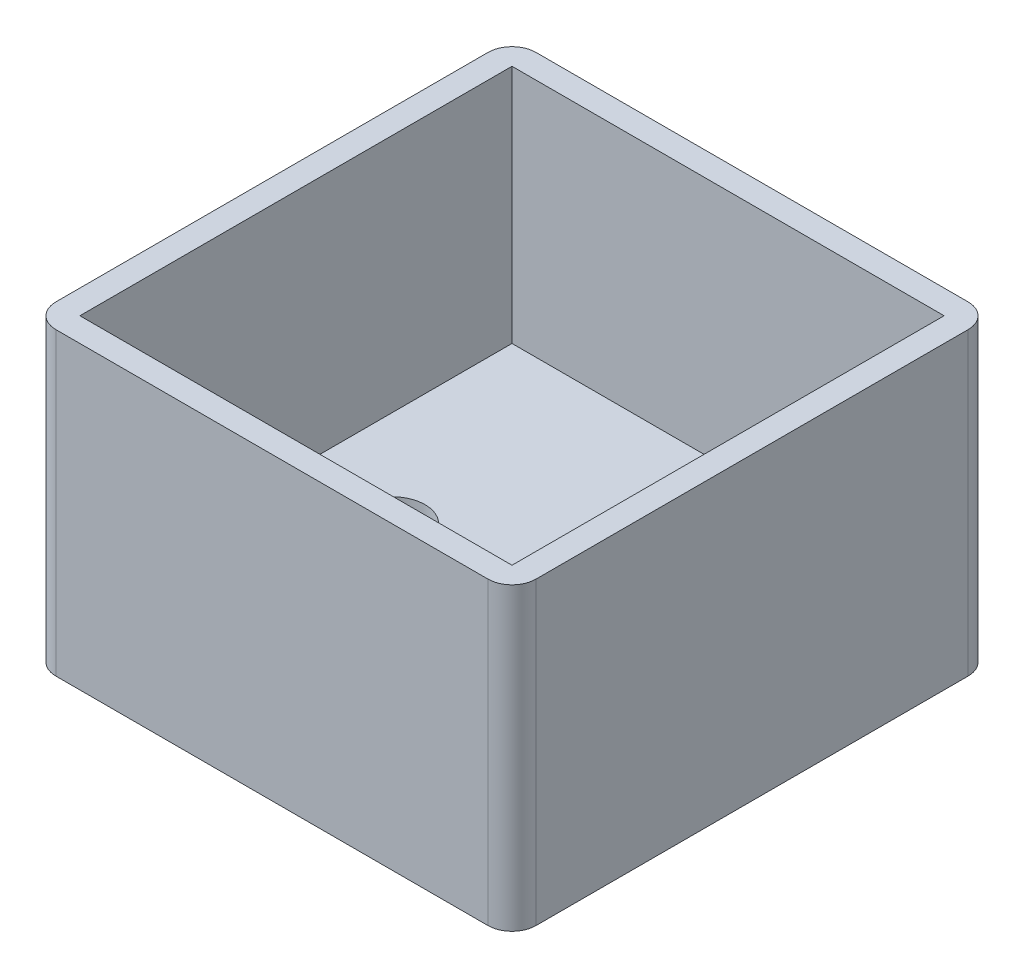
ISO-10303-21;
HEADER;
FILE_DESCRIPTION(('STEP AP214'),'2;1');
FILE_NAME('part.step','',(''),(''),'','','');
FILE_SCHEMA(('AUTOMOTIVE_DESIGN { 1 0 10303 214 1 1 1 1 }'));
ENDSEC;
DATA;
#1=APPLICATION_CONTEXT('core data for automotive mechanical design processes');
#2=APPLICATION_PROTOCOL_DEFINITION('international standard','automotive_design',2000,#1);
#3=PRODUCT_CONTEXT('',#1,'mechanical');
#4=PRODUCT('Part','Part','',(#3));
#5=PRODUCT_RELATED_PRODUCT_CATEGORY('part','',(#4));
#6=PRODUCT_DEFINITION_FORMATION('','',#4);
#7=PRODUCT_DEFINITION_CONTEXT('part definition',#1,'design');
#8=PRODUCT_DEFINITION('design','',#6,#7);
#9=PRODUCT_DEFINITION_SHAPE('','',#8);
#10=(LENGTH_UNIT() NAMED_UNIT(*) SI_UNIT(.MILLI.,.METRE.));
#11=(NAMED_UNIT(*) PLANE_ANGLE_UNIT() SI_UNIT($,.RADIAN.));
#12=(NAMED_UNIT(*) SI_UNIT($,.STERADIAN.) SOLID_ANGLE_UNIT());
#13=UNCERTAINTY_MEASURE_WITH_UNIT(LENGTH_MEASURE(1.E-05),#10,'distance_accuracy_value','');
#14=(GEOMETRIC_REPRESENTATION_CONTEXT(3) GLOBAL_UNCERTAINTY_ASSIGNED_CONTEXT((#13)) GLOBAL_UNIT_ASSIGNED_CONTEXT((#10,
#11,#12)) REPRESENTATION_CONTEXT('',''));
#15=CARTESIAN_POINT('',(0.,0.,0.));
#16=DIRECTION('',(0.,0.,1.));
#17=DIRECTION('',(1.,0.,0.));
#18=AXIS2_PLACEMENT_3D('',#15,#16,#17);
#19=CARTESIAN_POINT('',(2.,5.,-2.));
#20=DIRECTION('',(0.,1.,0.));
#21=DIRECTION('',(0.,0.,1.));
#22=AXIS2_PLACEMENT_3D('',#19,#20,#21);
#23=PLANE('',#22);
#24=DIRECTION('',(-1.,0.,0.));
#25=VECTOR('',#24,1.);
#26=CARTESIAN_POINT('',(38.,5.,-38.));
#27=LINE('',#26,#25);
#28=CARTESIAN_POINT('',(38.,5.,-38.));
#29=VERTEX_POINT('',#28);
#30=CARTESIAN_POINT('',(2.,5.,-38.));
#31=VERTEX_POINT('',#30);
#32=EDGE_CURVE('E54',#29,#31,#27,.T.);
#33=ORIENTED_EDGE('',*,*,#32,.T.);
#34=DIRECTION('',(0.,0.,1.));
#35=VECTOR('',#34,1.);
#36=CARTESIAN_POINT('',(2.,5.,-38.));
#37=LINE('',#36,#35);
#38=CARTESIAN_POINT('',(2.,5.,-2.));
#39=VERTEX_POINT('',#38);
#40=EDGE_CURVE('E58',#31,#39,#37,.T.);
#41=ORIENTED_EDGE('',*,*,#40,.T.);
#42=DIRECTION('',(1.,0.,0.));
#43=VECTOR('',#42,1.);
#44=CARTESIAN_POINT('',(2.,5.,-2.));
#45=LINE('',#44,#43);
#46=CARTESIAN_POINT('',(38.,5.,-2.));
#47=VERTEX_POINT('',#46);
#48=EDGE_CURVE('E156',#39,#47,#45,.T.);
#49=ORIENTED_EDGE('',*,*,#48,.T.);
#50=DIRECTION('',(0.,0.,-1.));
#51=VECTOR('',#50,1.);
#52=CARTESIAN_POINT('',(38.,5.,-2.));
#53=LINE('',#52,#51);
#54=EDGE_CURVE('E137',#47,#29,#53,.T.);
#55=ORIENTED_EDGE('',*,*,#54,.T.);
#56=EDGE_LOOP('',(#33,#41,#49,#55));
#57=FACE_BOUND('',#56,.T.);
#58=CARTESIAN_POINT('',(10.,5.,-20.));
#59=DIRECTION('',(0.,1.,0.));
#60=DIRECTION('',(0.,0.,1.));
#61=AXIS2_PLACEMENT_3D('',#58,#59,#60);
#62=CIRCLE('',#61,2.75);
#63=CARTESIAN_POINT('',(10.,5.,-17.25));
#64=VERTEX_POINT('',#63);
#65=EDGE_CURVE('E194',#64,#64,#62,.T.);
#66=ORIENTED_EDGE('',*,*,#65,.F.);
#67=EDGE_LOOP('',(#66));
#68=FACE_BOUND('',#67,.T.);
#69=CARTESIAN_POINT('',(30.,5.,-20.));
#70=DIRECTION('',(0.,1.,0.));
#71=DIRECTION('',(0.,0.,-1.));
#72=AXIS2_PLACEMENT_3D('',#69,#70,#71);
#73=CIRCLE('',#72,2.75);
#74=CARTESIAN_POINT('',(30.,5.,-22.75));
#75=VERTEX_POINT('',#74);
#76=EDGE_CURVE('E188',#75,#75,#73,.T.);
#77=ORIENTED_EDGE('',*,*,#76,.F.);
#78=EDGE_LOOP('',(#77));
#79=FACE_BOUND('',#78,.T.);
#80=ADVANCED_FACE('F39',(#57,#68,#79),#23,.T.);
#81=CARTESIAN_POINT('',(2.,0.,-2.));
#82=DIRECTION('',(0.,1.,0.));
#83=DIRECTION('',(0.,0.,1.));
#84=AXIS2_PLACEMENT_3D('',#81,#82,#83);
#85=PLANE('',#84);
#86=CARTESIAN_POINT('',(2.,0.,-2.));
#87=DIRECTION('',(0.,1.,0.));
#88=DIRECTION('',(0.,0.,1.));
#89=AXIS2_PLACEMENT_3D('',#86,#87,#88);
#90=CIRCLE('',#89,2.);
#91=CARTESIAN_POINT('',(0.,0.,-2.00000000000001));
#92=VERTEX_POINT('',#91);
#93=CARTESIAN_POINT('',(2.00000000000001,0.,0.));
#94=VERTEX_POINT('',#93);
#95=EDGE_CURVE('E197',#92,#94,#90,.T.);
#96=ORIENTED_EDGE('',*,*,#95,.F.);
#97=DIRECTION('',(0.,0.,1.));
#98=VECTOR('',#97,1.);
#99=CARTESIAN_POINT('',(0.,0.,-2.00000000000001));
#100=LINE('',#99,#98);
#101=CARTESIAN_POINT('',(0.,0.,-38.));
#102=VERTEX_POINT('',#101);
#103=EDGE_CURVE('E214',#102,#92,#100,.T.);
#104=ORIENTED_EDGE('',*,*,#103,.F.);
#105=CARTESIAN_POINT('',(2.,0.,-38.));
#106=DIRECTION('',(0.,1.,0.));
#107=DIRECTION('',(0.,0.,1.));
#108=AXIS2_PLACEMENT_3D('',#105,#106,#107);
#109=CIRCLE('',#108,2.);
#110=CARTESIAN_POINT('',(2.00000000000001,0.,-40.));
#111=VERTEX_POINT('',#110);
#112=EDGE_CURVE('E212',#111,#102,#109,.T.);
#113=ORIENTED_EDGE('',*,*,#112,.F.);
#114=DIRECTION('',(-1.,0.,0.));
#115=VECTOR('',#114,1.);
#116=CARTESIAN_POINT('',(2.00000000000001,0.,-40.));
#117=LINE('',#116,#115);
#118=CARTESIAN_POINT('',(38.,0.,-40.));
#119=VERTEX_POINT('',#118);
#120=EDGE_CURVE('E210',#119,#111,#117,.T.);
#121=ORIENTED_EDGE('',*,*,#120,.F.);
#122=CARTESIAN_POINT('',(38.,0.,-38.));
#123=DIRECTION('',(0.,1.,0.));
#124=DIRECTION('',(0.,0.,1.));
#125=AXIS2_PLACEMENT_3D('',#122,#123,#124);
#126=CIRCLE('',#125,2.);
#127=CARTESIAN_POINT('',(40.,0.,-38.));
#128=VERTEX_POINT('',#127);
#129=EDGE_CURVE('E208',#128,#119,#126,.T.);
#130=ORIENTED_EDGE('',*,*,#129,.F.);
#131=DIRECTION('',(0.,0.,-1.));
#132=VECTOR('',#131,1.);
#133=CARTESIAN_POINT('',(40.,0.,-2.00000000000001));
#134=LINE('',#133,#132);
#135=CARTESIAN_POINT('',(40.,0.,-2.00000000000001));
#136=VERTEX_POINT('',#135);
#137=EDGE_CURVE('E206',#136,#128,#134,.T.);
#138=ORIENTED_EDGE('',*,*,#137,.F.);
#139=CARTESIAN_POINT('',(38.,0.,-2.));
#140=DIRECTION('',(0.,1.,0.));
#141=DIRECTION('',(0.,0.,1.));
#142=AXIS2_PLACEMENT_3D('',#139,#140,#141);
#143=CIRCLE('',#142,2.);
#144=CARTESIAN_POINT('',(38.,0.,0.));
#145=VERTEX_POINT('',#144);
#146=EDGE_CURVE('E204',#145,#136,#143,.T.);
#147=ORIENTED_EDGE('',*,*,#146,.F.);
#148=DIRECTION('',(1.,0.,0.));
#149=VECTOR('',#148,1.);
#150=CARTESIAN_POINT('',(2.00000000000001,0.,0.));
#151=LINE('',#150,#149);
#152=EDGE_CURVE('E202',#94,#145,#151,.T.);
#153=ORIENTED_EDGE('',*,*,#152,.F.);
#154=EDGE_LOOP('',(#96,#104,#113,#121,#130,#138,#147,#153));
#155=FACE_BOUND('',#154,.T.);
#156=CARTESIAN_POINT('',(10.,0.,-20.));
#157=DIRECTION('',(0.,1.,0.));
#158=DIRECTION('',(0.,0.,1.));
#159=AXIS2_PLACEMENT_3D('',#156,#157,#158);
#160=CIRCLE('',#159,2.75);
#161=CARTESIAN_POINT('',(10.,0.,-17.25));
#162=VERTEX_POINT('',#161);
#163=EDGE_CURVE('E191',#162,#162,#160,.T.);
#164=ORIENTED_EDGE('',*,*,#163,.T.);
#165=EDGE_LOOP('',(#164));
#166=FACE_BOUND('',#165,.T.);
#167=CARTESIAN_POINT('',(30.,0.,-20.));
#168=DIRECTION('',(0.,1.,0.));
#169=DIRECTION('',(0.,0.,-1.));
#170=AXIS2_PLACEMENT_3D('',#167,#168,#169);
#171=CIRCLE('',#170,2.75);
#172=CARTESIAN_POINT('',(30.,0.,-22.75));
#173=VERTEX_POINT('',#172);
#174=EDGE_CURVE('E187',#173,#173,#171,.T.);
#175=ORIENTED_EDGE('',*,*,#174,.T.);
#176=EDGE_LOOP('',(#175));
#177=FACE_BOUND('',#176,.T.);
#178=ADVANCED_FACE('F243',(#155,#166,#177),#85,.F.);
#179=CARTESIAN_POINT('',(2.,5.,-2.));
#180=DIRECTION('',(0.,-1.,0.));
#181=DIRECTION('',(0.,0.,-1.));
#182=AXIS2_PLACEMENT_3D('',#179,#180,#181);
#183=CYLINDRICAL_SURFACE('',#182,2.);
#184=ORIENTED_EDGE('',*,*,#95,.T.);
#185=DIRECTION('',(0.,-1.,0.));
#186=VECTOR('',#185,1.);
#187=CARTESIAN_POINT('',(2.00000000000001,5.,0.));
#188=LINE('',#187,#186);
#189=CARTESIAN_POINT('',(2.00000000000001,25.,0.));
#190=VERTEX_POINT('',#189);
#191=EDGE_CURVE('E11',#190,#94,#188,.T.);
#192=ORIENTED_EDGE('',*,*,#191,.F.);
#193=CARTESIAN_POINT('',(2.,25.,-2.));
#194=DIRECTION('',(0.,1.,0.));
#195=DIRECTION('',(0.,0.,1.));
#196=AXIS2_PLACEMENT_3D('',#193,#194,#195);
#197=CIRCLE('',#196,2.);
#198=CARTESIAN_POINT('',(0.,25.,-2.00000000000001));
#199=VERTEX_POINT('',#198);
#200=EDGE_CURVE('E142',#199,#190,#197,.T.);
#201=ORIENTED_EDGE('',*,*,#200,.F.);
#202=DIRECTION('',(0.,-1.,0.));
#203=VECTOR('',#202,1.);
#204=CARTESIAN_POINT('',(0.,5.,-2.00000000000001));
#205=LINE('',#204,#203);
#206=EDGE_CURVE('E216',#199,#92,#205,.T.);
#207=ORIENTED_EDGE('',*,*,#206,.T.);
#208=EDGE_LOOP('',(#184,#192,#201,#207));
#209=FACE_BOUND('',#208,.T.);
#210=ADVANCED_FACE('F41',(#209),#183,.T.);
#211=CARTESIAN_POINT('',(2.00000000000001,5.,0.));
#212=DIRECTION('',(0.,0.,-1.));
#213=DIRECTION('',(-1.,0.,0.));
#214=AXIS2_PLACEMENT_3D('',#211,#212,#213);
#215=PLANE('',#214);
#216=ORIENTED_EDGE('',*,*,#152,.T.);
#217=DIRECTION('',(0.,-1.,0.));
#218=VECTOR('',#217,1.);
#219=CARTESIAN_POINT('',(38.,5.,0.));
#220=LINE('',#219,#218);
#221=CARTESIAN_POINT('',(38.,25.,0.));
#222=VERTEX_POINT('',#221);
#223=EDGE_CURVE('E47',#222,#145,#220,.T.);
#224=ORIENTED_EDGE('',*,*,#223,.F.);
#225=DIRECTION('',(1.,0.,0.));
#226=VECTOR('',#225,1.);
#227=CARTESIAN_POINT('',(2.00000000000001,25.,0.));
#228=LINE('',#227,#226);
#229=EDGE_CURVE('E166',#190,#222,#228,.T.);
#230=ORIENTED_EDGE('',*,*,#229,.F.);
#231=ORIENTED_EDGE('',*,*,#191,.T.);
#232=EDGE_LOOP('',(#216,#224,#230,#231));
#233=FACE_BOUND('',#232,.T.);
#234=ADVANCED_FACE('F267',(#233),#215,.F.);
#235=CARTESIAN_POINT('',(38.,5.,-2.));
#236=DIRECTION('',(0.,-1.,0.));
#237=DIRECTION('',(0.,0.,-1.));
#238=AXIS2_PLACEMENT_3D('',#235,#236,#237);
#239=CYLINDRICAL_SURFACE('',#238,2.);
#240=ORIENTED_EDGE('',*,*,#146,.T.);
#241=DIRECTION('',(0.,-1.,0.));
#242=VECTOR('',#241,1.);
#243=CARTESIAN_POINT('',(40.,5.,-2.00000000000001));
#244=LINE('',#243,#242);
#245=CARTESIAN_POINT('',(40.,25.,-2.));
#246=VERTEX_POINT('',#245);
#247=EDGE_CURVE('E231',#246,#136,#244,.T.);
#248=ORIENTED_EDGE('',*,*,#247,.F.);
#249=CARTESIAN_POINT('',(38.,25.,-2.));
#250=DIRECTION('',(0.,1.,0.));
#251=DIRECTION('',(0.,0.,1.));
#252=AXIS2_PLACEMENT_3D('',#249,#250,#251);
#253=CIRCLE('',#252,2.);
#254=EDGE_CURVE('E169',#222,#246,#253,.T.);
#255=ORIENTED_EDGE('',*,*,#254,.F.);
#256=ORIENTED_EDGE('',*,*,#223,.T.);
#257=EDGE_LOOP('',(#240,#248,#255,#256));
#258=FACE_BOUND('',#257,.T.);
#259=ADVANCED_FACE('F237',(#258),#239,.T.);
#260=CARTESIAN_POINT('',(40.,5.,-2.00000000000001));
#261=DIRECTION('',(-1.,0.,0.));
#262=DIRECTION('',(0.,0.,1.));
#263=AXIS2_PLACEMENT_3D('',#260,#261,#262);
#264=PLANE('',#263);
#265=ORIENTED_EDGE('',*,*,#137,.T.);
#266=DIRECTION('',(0.,-1.,0.));
#267=VECTOR('',#266,1.);
#268=CARTESIAN_POINT('',(40.,5.,-38.));
#269=LINE('',#268,#267);
#270=CARTESIAN_POINT('',(40.,25.,-38.));
#271=VERTEX_POINT('',#270);
#272=EDGE_CURVE('E228',#271,#128,#269,.T.);
#273=ORIENTED_EDGE('',*,*,#272,.F.);
#274=DIRECTION('',(0.,0.,-1.));
#275=VECTOR('',#274,1.);
#276=CARTESIAN_POINT('',(40.,25.,-2.));
#277=LINE('',#276,#275);
#278=EDGE_CURVE('E172',#246,#271,#277,.T.);
#279=ORIENTED_EDGE('',*,*,#278,.F.);
#280=ORIENTED_EDGE('',*,*,#247,.T.);
#281=EDGE_LOOP('',(#265,#273,#279,#280));
#282=FACE_BOUND('',#281,.T.);
#283=ADVANCED_FACE('F248',(#282),#264,.F.);
#284=CARTESIAN_POINT('',(38.,5.,-38.));
#285=DIRECTION('',(0.,-1.,0.));
#286=DIRECTION('',(0.,0.,-1.));
#287=AXIS2_PLACEMENT_3D('',#284,#285,#286);
#288=CYLINDRICAL_SURFACE('',#287,2.);
#289=ORIENTED_EDGE('',*,*,#129,.T.);
#290=DIRECTION('',(0.,-1.,0.));
#291=VECTOR('',#290,1.);
#292=CARTESIAN_POINT('',(38.,5.,-40.));
#293=LINE('',#292,#291);
#294=CARTESIAN_POINT('',(38.,25.,-40.));
#295=VERTEX_POINT('',#294);
#296=EDGE_CURVE('E225',#295,#119,#293,.T.);
#297=ORIENTED_EDGE('',*,*,#296,.F.);
#298=CARTESIAN_POINT('',(38.,25.,-38.));
#299=DIRECTION('',(0.,1.,0.));
#300=DIRECTION('',(0.,0.,1.));
#301=AXIS2_PLACEMENT_3D('',#298,#299,#300);
#302=CIRCLE('',#301,2.);
#303=EDGE_CURVE('E175',#271,#295,#302,.T.);
#304=ORIENTED_EDGE('',*,*,#303,.F.);
#305=ORIENTED_EDGE('',*,*,#272,.T.);
#306=EDGE_LOOP('',(#289,#297,#304,#305));
#307=FACE_BOUND('',#306,.T.);
#308=ADVANCED_FACE('F252',(#307),#288,.T.);
#309=CARTESIAN_POINT('',(2.00000000000001,5.,-40.));
#310=DIRECTION('',(0.,0.,1.));
#311=DIRECTION('',(1.,0.,0.));
#312=AXIS2_PLACEMENT_3D('',#309,#310,#311);
#313=PLANE('',#312);
#314=ORIENTED_EDGE('',*,*,#120,.T.);
#315=DIRECTION('',(0.,-1.,0.));
#316=VECTOR('',#315,1.);
#317=CARTESIAN_POINT('',(2.00000000000001,5.,-40.));
#318=LINE('',#317,#316);
#319=CARTESIAN_POINT('',(2.00000000000001,25.,-40.));
#320=VERTEX_POINT('',#319);
#321=EDGE_CURVE('E222',#320,#111,#318,.T.);
#322=ORIENTED_EDGE('',*,*,#321,.F.);
#323=DIRECTION('',(-1.,0.,0.));
#324=VECTOR('',#323,1.);
#325=CARTESIAN_POINT('',(38.,25.,-40.));
#326=LINE('',#325,#324);
#327=EDGE_CURVE('E178',#295,#320,#326,.T.);
#328=ORIENTED_EDGE('',*,*,#327,.F.);
#329=ORIENTED_EDGE('',*,*,#296,.T.);
#330=EDGE_LOOP('',(#314,#322,#328,#329));
#331=FACE_BOUND('',#330,.T.);
#332=ADVANCED_FACE('F257',(#331),#313,.F.);
#333=CARTESIAN_POINT('',(2.,5.,-38.));
#334=DIRECTION('',(0.,-1.,0.));
#335=DIRECTION('',(0.,0.,-1.));
#336=AXIS2_PLACEMENT_3D('',#333,#334,#335);
#337=CYLINDRICAL_SURFACE('',#336,2.);
#338=ORIENTED_EDGE('',*,*,#112,.T.);
#339=DIRECTION('',(0.,-1.,0.));
#340=VECTOR('',#339,1.);
#341=CARTESIAN_POINT('',(0.,5.,-38.));
#342=LINE('',#341,#340);
#343=CARTESIAN_POINT('',(0.,25.,-38.));
#344=VERTEX_POINT('',#343);
#345=EDGE_CURVE('E219',#344,#102,#342,.T.);
#346=ORIENTED_EDGE('',*,*,#345,.F.);
#347=CARTESIAN_POINT('',(2.,25.,-38.));
#348=DIRECTION('',(0.,1.,0.));
#349=DIRECTION('',(0.,0.,1.));
#350=AXIS2_PLACEMENT_3D('',#347,#348,#349);
#351=CIRCLE('',#350,2.);
#352=EDGE_CURVE('E181',#320,#344,#351,.T.);
#353=ORIENTED_EDGE('',*,*,#352,.F.);
#354=ORIENTED_EDGE('',*,*,#321,.T.);
#355=EDGE_LOOP('',(#338,#346,#353,#354));
#356=FACE_BOUND('',#355,.T.);
#357=ADVANCED_FACE('F260',(#356),#337,.T.);
#358=CARTESIAN_POINT('',(0.,5.,-2.00000000000001));
#359=DIRECTION('',(1.,0.,0.));
#360=DIRECTION('',(0.,0.,-1.));
#361=AXIS2_PLACEMENT_3D('',#358,#359,#360);
#362=PLANE('',#361);
#363=ORIENTED_EDGE('',*,*,#103,.T.);
#364=ORIENTED_EDGE('',*,*,#206,.F.);
#365=DIRECTION('',(0.,0.,1.));
#366=VECTOR('',#365,1.);
#367=CARTESIAN_POINT('',(0.,25.,-38.));
#368=LINE('',#367,#366);
#369=EDGE_CURVE('E184',#344,#199,#368,.T.);
#370=ORIENTED_EDGE('',*,*,#369,.F.);
#371=ORIENTED_EDGE('',*,*,#345,.T.);
#372=EDGE_LOOP('',(#363,#364,#370,#371));
#373=FACE_BOUND('',#372,.T.);
#374=ADVANCED_FACE('F263',(#373),#362,.F.);
#375=CARTESIAN_POINT('',(10.,5.,-20.));
#376=DIRECTION('',(0.,-1.,0.));
#377=DIRECTION('',(0.,0.,-1.));
#378=AXIS2_PLACEMENT_3D('',#375,#376,#377);
#379=CYLINDRICAL_SURFACE('',#378,2.75);
#380=ORIENTED_EDGE('',*,*,#65,.T.);
#381=EDGE_LOOP('',(#380));
#382=FACE_BOUND('',#381,.T.);
#383=ORIENTED_EDGE('',*,*,#163,.F.);
#384=EDGE_LOOP('',(#383));
#385=FACE_BOUND('',#384,.T.);
#386=ADVANCED_FACE('F283',(#382,#385),#379,.F.);
#387=CARTESIAN_POINT('',(30.,5.,-20.));
#388=DIRECTION('',(0.,-1.,0.));
#389=DIRECTION('',(0.,0.,-1.));
#390=AXIS2_PLACEMENT_3D('',#387,#388,#389);
#391=CYLINDRICAL_SURFACE('',#390,2.75);
#392=ORIENTED_EDGE('',*,*,#76,.T.);
#393=EDGE_LOOP('',(#392));
#394=FACE_BOUND('',#393,.T.);
#395=ORIENTED_EDGE('',*,*,#174,.F.);
#396=EDGE_LOOP('',(#395));
#397=FACE_BOUND('',#396,.T.);
#398=ADVANCED_FACE('F326',(#394,#397),#391,.F.);
#399=CARTESIAN_POINT('',(2.,25.,-2.));
#400=DIRECTION('',(0.,1.,0.));
#401=DIRECTION('',(0.,0.,1.));
#402=AXIS2_PLACEMENT_3D('',#399,#400,#401);
#403=PLANE('',#402);
#404=ORIENTED_EDGE('',*,*,#200,.T.);
#405=ORIENTED_EDGE('',*,*,#229,.T.);
#406=ORIENTED_EDGE('',*,*,#254,.T.);
#407=ORIENTED_EDGE('',*,*,#278,.T.);
#408=ORIENTED_EDGE('',*,*,#303,.T.);
#409=ORIENTED_EDGE('',*,*,#327,.T.);
#410=ORIENTED_EDGE('',*,*,#352,.T.);
#411=ORIENTED_EDGE('',*,*,#369,.T.);
#412=EDGE_LOOP('',(#404,#405,#406,#407,#408,#409,#410,#411));
#413=FACE_BOUND('',#412,.T.);
#414=DIRECTION('',(0.,0.,1.));
#415=VECTOR('',#414,1.);
#416=CARTESIAN_POINT('',(2.,25.,-38.));
#417=LINE('',#416,#415);
#418=CARTESIAN_POINT('',(2.,25.,-38.));
#419=VERTEX_POINT('',#418);
#420=CARTESIAN_POINT('',(2.,25.,-2.));
#421=VERTEX_POINT('',#420);
#422=EDGE_CURVE('E136',#419,#421,#417,.T.);
#423=ORIENTED_EDGE('',*,*,#422,.F.);
#424=DIRECTION('',(-1.,0.,0.));
#425=VECTOR('',#424,1.);
#426=CARTESIAN_POINT('',(38.,25.,-38.));
#427=LINE('',#426,#425);
#428=CARTESIAN_POINT('',(38.,25.,-38.));
#429=VERTEX_POINT('',#428);
#430=EDGE_CURVE('E127',#429,#419,#427,.T.);
#431=ORIENTED_EDGE('',*,*,#430,.F.);
#432=DIRECTION('',(0.,0.,-1.));
#433=VECTOR('',#432,1.);
#434=CARTESIAN_POINT('',(38.,25.,-2.));
#435=LINE('',#434,#433);
#436=CARTESIAN_POINT('',(38.,25.,-2.));
#437=VERTEX_POINT('',#436);
#438=EDGE_CURVE('E150',#437,#429,#435,.T.);
#439=ORIENTED_EDGE('',*,*,#438,.F.);
#440=DIRECTION('',(1.,0.,0.));
#441=VECTOR('',#440,1.);
#442=CARTESIAN_POINT('',(2.,25.,-2.));
#443=LINE('',#442,#441);
#444=EDGE_CURVE('E148',#421,#437,#443,.T.);
#445=ORIENTED_EDGE('',*,*,#444,.F.);
#446=EDGE_LOOP('',(#423,#431,#439,#445));
#447=FACE_BOUND('',#446,.T.);
#448=ADVANCED_FACE('F146',(#413,#447),#403,.T.);
#449=CARTESIAN_POINT('',(38.,25.,-38.));
#450=DIRECTION('',(0.,0.,1.));
#451=DIRECTION('',(1.,0.,0.));
#452=AXIS2_PLACEMENT_3D('',#449,#450,#451);
#453=PLANE('',#452);
#454=ORIENTED_EDGE('',*,*,#32,.F.);
#455=DIRECTION('',(0.,-1.,0.));
#456=VECTOR('',#455,1.);
#457=CARTESIAN_POINT('',(38.,25.,-38.));
#458=LINE('',#457,#456);
#459=EDGE_CURVE('E132',#429,#29,#458,.T.);
#460=ORIENTED_EDGE('',*,*,#459,.F.);
#461=ORIENTED_EDGE('',*,*,#430,.T.);
#462=DIRECTION('',(0.,-1.,0.));
#463=VECTOR('',#462,1.);
#464=CARTESIAN_POINT('',(2.,25.,-38.));
#465=LINE('',#464,#463);
#466=EDGE_CURVE('E130',#419,#31,#465,.T.);
#467=ORIENTED_EDGE('',*,*,#466,.T.);
#468=EDGE_LOOP('',(#454,#460,#461,#467));
#469=FACE_BOUND('',#468,.T.);
#470=ADVANCED_FACE('F129',(#469),#453,.T.);
#471=CARTESIAN_POINT('',(2.,25.,-38.));
#472=DIRECTION('',(1.,0.,0.));
#473=DIRECTION('',(0.,0.,-1.));
#474=AXIS2_PLACEMENT_3D('',#471,#472,#473);
#475=PLANE('',#474);
#476=ORIENTED_EDGE('',*,*,#40,.F.);
#477=ORIENTED_EDGE('',*,*,#466,.F.);
#478=ORIENTED_EDGE('',*,*,#422,.T.);
#479=DIRECTION('',(0.,-1.,0.));
#480=VECTOR('',#479,1.);
#481=CARTESIAN_POINT('',(2.,25.,-2.));
#482=LINE('',#481,#480);
#483=EDGE_CURVE('E143',#421,#39,#482,.T.);
#484=ORIENTED_EDGE('',*,*,#483,.T.);
#485=EDGE_LOOP('',(#476,#477,#478,#484));
#486=FACE_BOUND('',#485,.T.);
#487=ADVANCED_FACE('F140',(#486),#475,.T.);
#488=CARTESIAN_POINT('',(2.,25.,-2.));
#489=DIRECTION('',(0.,0.,-1.));
#490=DIRECTION('',(-1.,0.,0.));
#491=AXIS2_PLACEMENT_3D('',#488,#489,#490);
#492=PLANE('',#491);
#493=ORIENTED_EDGE('',*,*,#48,.F.);
#494=ORIENTED_EDGE('',*,*,#483,.F.);
#495=ORIENTED_EDGE('',*,*,#444,.T.);
#496=DIRECTION('',(0.,-1.,0.));
#497=VECTOR('',#496,1.);
#498=CARTESIAN_POINT('',(38.,25.,-2.));
#499=LINE('',#498,#497);
#500=EDGE_CURVE('E160',#437,#47,#499,.T.);
#501=ORIENTED_EDGE('',*,*,#500,.T.);
#502=EDGE_LOOP('',(#493,#494,#495,#501));
#503=FACE_BOUND('',#502,.T.);
#504=ADVANCED_FACE('F341',(#503),#492,.T.);
#505=CARTESIAN_POINT('',(38.,25.,-2.));
#506=DIRECTION('',(-1.,0.,0.));
#507=DIRECTION('',(0.,0.,1.));
#508=AXIS2_PLACEMENT_3D('',#505,#506,#507);
#509=PLANE('',#508);
#510=ORIENTED_EDGE('',*,*,#54,.F.);
#511=ORIENTED_EDGE('',*,*,#500,.F.);
#512=ORIENTED_EDGE('',*,*,#438,.T.);
#513=ORIENTED_EDGE('',*,*,#459,.T.);
#514=EDGE_LOOP('',(#510,#511,#512,#513));
#515=FACE_BOUND('',#514,.T.);
#516=ADVANCED_FACE('F349',(#515),#509,.T.);
#517=CLOSED_SHELL('',(#80,#178,#210,#234,#259,#283,#308,#332,#357,#374,#386,#398,#448,#470,#487,
#504,#516));
#518=MANIFOLD_SOLID_BREP('B2',#517);
#519=ADVANCED_BREP_SHAPE_REPRESENTATION('',(#18,#518),#14);
#520=SHAPE_DEFINITION_REPRESENTATION(#9,#519);
ENDSEC;
END-ISO-10303-21;
